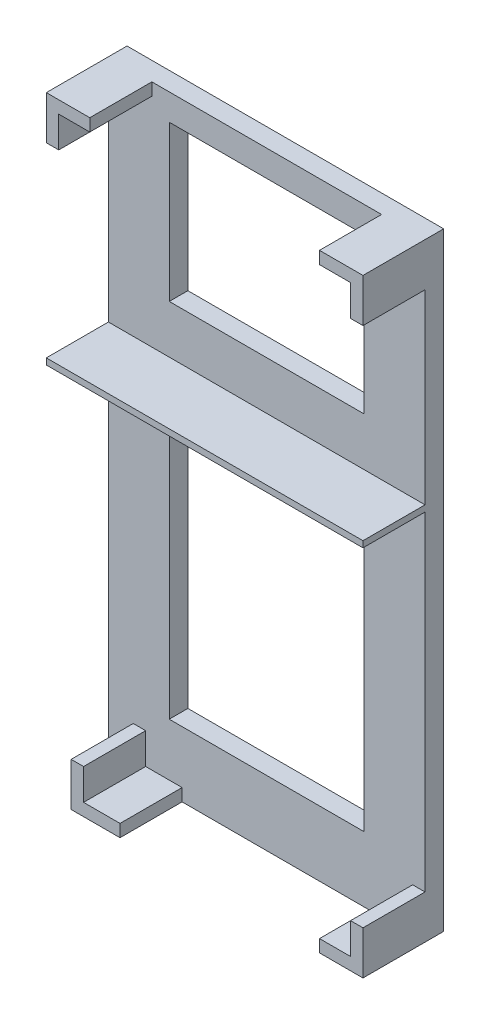
ISO-10303-21;
HEADER;
FILE_DESCRIPTION(('STEP AP214'),'2;1');
FILE_NAME('part.step','',(''),(''),'','','');
FILE_SCHEMA(('AUTOMOTIVE_DESIGN { 1 0 10303 214 1 1 1 1 }'));
ENDSEC;
DATA;
#1=APPLICATION_CONTEXT('core data for automotive mechanical design processes');
#2=APPLICATION_PROTOCOL_DEFINITION('international standard','automotive_design',2000,#1);
#3=PRODUCT_CONTEXT('',#1,'mechanical');
#4=PRODUCT('Part','Part','',(#3));
#5=PRODUCT_RELATED_PRODUCT_CATEGORY('part','',(#4));
#6=PRODUCT_DEFINITION_FORMATION('','',#4);
#7=PRODUCT_DEFINITION_CONTEXT('part definition',#1,'design');
#8=PRODUCT_DEFINITION('design','',#6,#7);
#9=PRODUCT_DEFINITION_SHAPE('','',#8);
#10=(LENGTH_UNIT() NAMED_UNIT(*) SI_UNIT(.MILLI.,.METRE.));
#11=(NAMED_UNIT(*) PLANE_ANGLE_UNIT() SI_UNIT($,.RADIAN.));
#12=(NAMED_UNIT(*) SI_UNIT($,.STERADIAN.) SOLID_ANGLE_UNIT());
#13=UNCERTAINTY_MEASURE_WITH_UNIT(LENGTH_MEASURE(1.E-05),#10,'distance_accuracy_value','');
#14=(GEOMETRIC_REPRESENTATION_CONTEXT(3) GLOBAL_UNCERTAINTY_ASSIGNED_CONTEXT((#13)) GLOBAL_UNIT_ASSIGNED_CONTEXT((#10,
#11,#12)) REPRESENTATION_CONTEXT('',''));
#15=CARTESIAN_POINT('',(0.,0.,0.));
#16=DIRECTION('',(0.,0.,1.));
#17=DIRECTION('',(1.,0.,0.));
#18=AXIS2_PLACEMENT_3D('',#15,#16,#17);
#19=CARTESIAN_POINT('',(0.,0.,3.));
#20=DIRECTION('',(0.,0.,1.));
#21=DIRECTION('',(1.,0.,0.));
#22=AXIS2_PLACEMENT_3D('',#19,#20,#21);
#23=PLANE('',#22);
#24=DIRECTION('',(0.,1.,0.));
#25=VECTOR('',#24,1.);
#26=CARTESIAN_POINT('',(41.2,10.5,3.));
#27=LINE('',#26,#25);
#28=CARTESIAN_POINT('',(41.2,10.5,3.));
#29=VERTEX_POINT('',#28);
#30=CARTESIAN_POINT('',(41.2,50.5,3.));
#31=VERTEX_POINT('',#30);
#32=EDGE_CURVE('E52',#29,#31,#27,.T.);
#33=ORIENTED_EDGE('',*,*,#32,.F.);
#34=DIRECTION('',(1.,0.,0.));
#35=VECTOR('',#34,1.);
#36=CARTESIAN_POINT('',(9.8,10.5,3.));
#37=LINE('',#36,#35);
#38=CARTESIAN_POINT('',(9.8,10.5,3.));
#39=VERTEX_POINT('',#38);
#40=EDGE_CURVE('E319',#39,#29,#37,.T.);
#41=ORIENTED_EDGE('',*,*,#40,.F.);
#42=DIRECTION('',(0.,-1.,0.));
#43=VECTOR('',#42,1.);
#44=CARTESIAN_POINT('',(9.8,50.5,3.));
#45=LINE('',#44,#43);
#46=CARTESIAN_POINT('',(9.8,50.5,3.));
#47=VERTEX_POINT('',#46);
#48=EDGE_CURVE('E322',#47,#39,#45,.T.);
#49=ORIENTED_EDGE('',*,*,#48,.F.);
#50=DIRECTION('',(-1.,0.,0.));
#51=VECTOR('',#50,1.);
#52=CARTESIAN_POINT('',(39.8,50.5,3.));
#53=LINE('',#52,#51);
#54=EDGE_CURVE('E325',#31,#47,#53,.T.);
#55=ORIENTED_EDGE('',*,*,#54,.F.);
#56=EDGE_LOOP('',(#33,#41,#49,#55));
#57=FACE_BOUND('',#56,.T.);
#58=DIRECTION('',(-1.,0.,0.));
#59=VECTOR('',#58,1.);
#60=CARTESIAN_POINT('',(51.,60.,3.));
#61=LINE('',#60,#59);
#62=CARTESIAN_POINT('',(51.,60.,3.));
#63=VERTEX_POINT('',#62);
#64=CARTESIAN_POINT('',(0.,60.,3.));
#65=VERTEX_POINT('',#64);
#66=EDGE_CURVE('E307',#63,#65,#61,.T.);
#67=ORIENTED_EDGE('',*,*,#66,.T.);
#68=DIRECTION('',(0.,1.,0.));
#69=VECTOR('',#68,1.);
#70=CARTESIAN_POINT('',(0.,0.,3.));
#71=LINE('',#70,#69);
#72=CARTESIAN_POINT('',(0.,0.,3.));
#73=VERTEX_POINT('',#72);
#74=EDGE_CURVE('E533',#73,#65,#71,.T.);
#75=ORIENTED_EDGE('',*,*,#74,.F.);
#76=DIRECTION('',(1.,0.,0.));
#77=VECTOR('',#76,1.);
#78=CARTESIAN_POINT('',(0.,0.,3.));
#79=LINE('',#78,#77);
#80=CARTESIAN_POINT('',(4.,0.,3.));
#81=VERTEX_POINT('',#80);
#82=EDGE_CURVE('E530',#73,#81,#79,.T.);
#83=ORIENTED_EDGE('',*,*,#82,.T.);
#84=DIRECTION('',(0.,1.,0.));
#85=VECTOR('',#84,1.);
#86=CARTESIAN_POINT('',(4.,0.,3.));
#87=LINE('',#86,#85);
#88=CARTESIAN_POINT('',(4.,7.,3.));
#89=VERTEX_POINT('',#88);
#90=EDGE_CURVE('E379',#81,#89,#87,.T.);
#91=ORIENTED_EDGE('',*,*,#90,.T.);
#92=DIRECTION('',(1.,0.,0.));
#93=VECTOR('',#92,1.);
#94=CARTESIAN_POINT('',(4.,7.,3.));
#95=LINE('',#94,#93);
#96=CARTESIAN_POINT('',(6.,7.,3.));
#97=VERTEX_POINT('',#96);
#98=EDGE_CURVE('E381',#89,#97,#95,.T.);
#99=ORIENTED_EDGE('',*,*,#98,.T.);
#100=DIRECTION('',(0.,-1.,0.));
#101=VECTOR('',#100,1.);
#102=CARTESIAN_POINT('',(6.,7.,3.));
#103=LINE('',#102,#101);
#104=CARTESIAN_POINT('',(6.,2.,3.));
#105=VERTEX_POINT('',#104);
#106=EDGE_CURVE('E383',#97,#105,#103,.T.);
#107=ORIENTED_EDGE('',*,*,#106,.T.);
#108=DIRECTION('',(1.,0.,0.));
#109=VECTOR('',#108,1.);
#110=CARTESIAN_POINT('',(6.,2.,3.));
#111=LINE('',#110,#109);
#112=CARTESIAN_POINT('',(11.8694826208288,2.,3.));
#113=VERTEX_POINT('',#112);
#114=EDGE_CURVE('E361',#105,#113,#111,.T.);
#115=ORIENTED_EDGE('',*,*,#114,.T.);
#116=DIRECTION('',(0.,-1.,0.));
#117=VECTOR('',#116,1.);
#118=CARTESIAN_POINT('',(11.8694826208288,2.,3.));
#119=LINE('',#118,#117);
#120=CARTESIAN_POINT('',(11.8694826208288,0.,3.));
#121=VERTEX_POINT('',#120);
#122=EDGE_CURVE('E348',#113,#121,#119,.T.);
#123=ORIENTED_EDGE('',*,*,#122,.T.);
#124=CARTESIAN_POINT('',(44.,0.,3.));
#125=VERTEX_POINT('',#124);
#126=EDGE_CURVE('E529',#121,#125,#79,.T.);
#127=ORIENTED_EDGE('',*,*,#126,.T.);
#128=DIRECTION('',(0.,-1.,0.));
#129=VECTOR('',#128,1.);
#130=CARTESIAN_POINT('',(44.,0.,3.));
#131=LINE('',#130,#129);
#132=CARTESIAN_POINT('',(44.,2.,3.));
#133=VERTEX_POINT('',#132);
#134=EDGE_CURVE('E408',#133,#125,#131,.T.);
#135=ORIENTED_EDGE('',*,*,#134,.F.);
#136=DIRECTION('',(-1.,0.,0.));
#137=VECTOR('',#136,1.);
#138=CARTESIAN_POINT('',(44.,2.,3.));
#139=LINE('',#138,#137);
#140=CARTESIAN_POINT('',(49.,2.,3.));
#141=VERTEX_POINT('',#140);
#142=EDGE_CURVE('E425',#141,#133,#139,.T.);
#143=ORIENTED_EDGE('',*,*,#142,.F.);
#144=DIRECTION('',(0.,-1.,0.));
#145=VECTOR('',#144,1.);
#146=CARTESIAN_POINT('',(49.,2.,3.));
#147=LINE('',#146,#145);
#148=CARTESIAN_POINT('',(49.,7.,3.));
#149=VERTEX_POINT('',#148);
#150=EDGE_CURVE('E422',#149,#141,#147,.T.);
#151=ORIENTED_EDGE('',*,*,#150,.F.);
#152=DIRECTION('',(-1.,0.,0.));
#153=VECTOR('',#152,1.);
#154=CARTESIAN_POINT('',(49.,7.,3.));
#155=LINE('',#154,#153);
#156=CARTESIAN_POINT('',(51.,7.,3.));
#157=VERTEX_POINT('',#156);
#158=EDGE_CURVE('E389',#157,#149,#155,.T.);
#159=ORIENTED_EDGE('',*,*,#158,.F.);
#160=DIRECTION('',(0.,1.,0.));
#161=VECTOR('',#160,1.);
#162=CARTESIAN_POINT('',(51.,0.,3.));
#163=LINE('',#162,#161);
#164=EDGE_CURVE('E527',#157,#63,#163,.T.);
#165=ORIENTED_EDGE('',*,*,#164,.T.);
#166=EDGE_LOOP('',(#67,#75,#83,#91,#99,#107,#115,#123,#127,#135,#143,#151,#159,#165));
#167=FACE_BOUND('',#166,.T.);
#168=ADVANCED_FACE('F37',(#57,#167),#23,.T.);
#169=DIRECTION('',(0.,1.,0.));
#170=VECTOR('',#169,1.);
#171=CARTESIAN_POINT('',(41.2,68.7705321312806,3.));
#172=LINE('',#171,#170);
#173=CARTESIAN_POINT('',(41.2,68.7705321312806,3.));
#174=VERTEX_POINT('',#173);
#175=CARTESIAN_POINT('',(41.2,93.7705321312806,3.));
#176=VERTEX_POINT('',#175);
#177=EDGE_CURVE('E60',#174,#176,#172,.T.);
#178=ORIENTED_EDGE('',*,*,#177,.F.);
#179=DIRECTION('',(1.,0.,0.));
#180=VECTOR('',#179,1.);
#181=CARTESIAN_POINT('',(9.8,68.7705321312806,3.));
#182=LINE('',#181,#180);
#183=CARTESIAN_POINT('',(9.8,68.7705321312806,3.));
#184=VERTEX_POINT('',#183);
#185=EDGE_CURVE('E300',#184,#174,#182,.T.);
#186=ORIENTED_EDGE('',*,*,#185,.F.);
#187=DIRECTION('',(0.,-1.,0.));
#188=VECTOR('',#187,1.);
#189=CARTESIAN_POINT('',(9.8,93.7705321312806,3.));
#190=LINE('',#189,#188);
#191=CARTESIAN_POINT('',(9.8,93.7705321312806,3.));
#192=VERTEX_POINT('',#191);
#193=EDGE_CURVE('E283',#192,#184,#190,.T.);
#194=ORIENTED_EDGE('',*,*,#193,.F.);
#195=DIRECTION('',(-1.,0.,0.));
#196=VECTOR('',#195,1.);
#197=CARTESIAN_POINT('',(39.8,93.7705321312806,3.));
#198=LINE('',#197,#196);
#199=EDGE_CURVE('E293',#176,#192,#198,.T.);
#200=ORIENTED_EDGE('',*,*,#199,.F.);
#201=EDGE_LOOP('',(#178,#186,#194,#200));
#202=FACE_BOUND('',#201,.T.);
#203=DIRECTION('',(1.,0.,0.));
#204=VECTOR('',#203,1.);
#205=CARTESIAN_POINT('',(0.,61.,3.));
#206=LINE('',#205,#204);
#207=CARTESIAN_POINT('',(0.,61.,3.));
#208=VERTEX_POINT('',#207);
#209=CARTESIAN_POINT('',(51.,61.,3.));
#210=VERTEX_POINT('',#209);
#211=EDGE_CURVE('E332',#208,#210,#206,.T.);
#212=ORIENTED_EDGE('',*,*,#211,.T.);
#213=CARTESIAN_POINT('',(51.,91.,3.));
#214=VERTEX_POINT('',#213);
#215=EDGE_CURVE('E525',#210,#214,#163,.T.);
#216=ORIENTED_EDGE('',*,*,#215,.T.);
#217=DIRECTION('',(1.,0.,0.));
#218=VECTOR('',#217,1.);
#219=CARTESIAN_POINT('',(49.,91.,3.));
#220=LINE('',#219,#218);
#221=CARTESIAN_POINT('',(49.,91.,3.));
#222=VERTEX_POINT('',#221);
#223=EDGE_CURVE('E449',#222,#214,#220,.T.);
#224=ORIENTED_EDGE('',*,*,#223,.F.);
#225=DIRECTION('',(0.,-1.,0.));
#226=VECTOR('',#225,1.);
#227=CARTESIAN_POINT('',(49.,96.,3.));
#228=LINE('',#227,#226);
#229=CARTESIAN_POINT('',(49.,96.,3.));
#230=VERTEX_POINT('',#229);
#231=EDGE_CURVE('E463',#230,#222,#228,.T.);
#232=ORIENTED_EDGE('',*,*,#231,.F.);
#233=DIRECTION('',(1.,0.,0.));
#234=VECTOR('',#233,1.);
#235=CARTESIAN_POINT('',(44.,96.,3.));
#236=LINE('',#235,#234);
#237=CARTESIAN_POINT('',(44.,96.,3.));
#238=VERTEX_POINT('',#237);
#239=EDGE_CURVE('E461',#238,#230,#236,.T.);
#240=ORIENTED_EDGE('',*,*,#239,.F.);
#241=DIRECTION('',(0.,-1.,0.));
#242=VECTOR('',#241,1.);
#243=CARTESIAN_POINT('',(44.,98.,3.));
#244=LINE('',#243,#242);
#245=CARTESIAN_POINT('',(44.,98.,3.));
#246=VERTEX_POINT('',#245);
#247=EDGE_CURVE('E444',#246,#238,#244,.T.);
#248=ORIENTED_EDGE('',*,*,#247,.F.);
#249=DIRECTION('',(1.,0.,0.));
#250=VECTOR('',#249,1.);
#251=CARTESIAN_POINT('',(0.,98.,3.));
#252=LINE('',#251,#250);
#253=CARTESIAN_POINT('',(7.,98.,3.));
#254=VERTEX_POINT('',#253);
#255=EDGE_CURVE('E522',#254,#246,#252,.T.);
#256=ORIENTED_EDGE('',*,*,#255,.F.);
#257=DIRECTION('',(0.,1.,0.));
#258=VECTOR('',#257,1.);
#259=CARTESIAN_POINT('',(7.,98.,3.));
#260=LINE('',#259,#258);
#261=CARTESIAN_POINT('',(7.,96.,3.));
#262=VERTEX_POINT('',#261);
#263=EDGE_CURVE('E485',#262,#254,#260,.T.);
#264=ORIENTED_EDGE('',*,*,#263,.F.);
#265=DIRECTION('',(1.,0.,0.));
#266=VECTOR('',#265,1.);
#267=CARTESIAN_POINT('',(7.,96.,3.));
#268=LINE('',#267,#266);
#269=CARTESIAN_POINT('',(2.,96.,3.));
#270=VERTEX_POINT('',#269);
#271=EDGE_CURVE('E502',#270,#262,#268,.T.);
#272=ORIENTED_EDGE('',*,*,#271,.F.);
#273=DIRECTION('',(0.,1.,0.));
#274=VECTOR('',#273,1.);
#275=CARTESIAN_POINT('',(2.,96.,3.));
#276=LINE('',#275,#274);
#277=CARTESIAN_POINT('',(2.,91.,3.));
#278=VERTEX_POINT('',#277);
#279=EDGE_CURVE('E499',#278,#270,#276,.T.);
#280=ORIENTED_EDGE('',*,*,#279,.F.);
#281=DIRECTION('',(1.,0.,0.));
#282=VECTOR('',#281,1.);
#283=CARTESIAN_POINT('',(2.,91.,3.));
#284=LINE('',#283,#282);
#285=CARTESIAN_POINT('',(0.,91.,3.));
#286=VERTEX_POINT('',#285);
#287=EDGE_CURVE('E480',#286,#278,#284,.T.);
#288=ORIENTED_EDGE('',*,*,#287,.F.);
#289=EDGE_CURVE('E532',#208,#286,#71,.T.);
#290=ORIENTED_EDGE('',*,*,#289,.F.);
#291=EDGE_LOOP('',(#212,#216,#224,#232,#240,#248,#256,#264,#272,#280,#288,#290));
#292=FACE_BOUND('',#291,.T.);
#293=ADVANCED_FACE('F297',(#202,#292),#23,.T.);
#294=CARTESIAN_POINT('',(0.,98.,3.));
#295=DIRECTION('',(0.,1.,0.));
#296=DIRECTION('',(0.,0.,1.));
#297=AXIS2_PLACEMENT_3D('',#294,#295,#296);
#298=PLANE('',#297);
#299=DIRECTION('',(1.,0.,0.));
#300=VECTOR('',#299,1.);
#301=CARTESIAN_POINT('',(0.,98.,0.));
#302=LINE('',#301,#300);
#303=CARTESIAN_POINT('',(0.,98.,0.));
#304=VERTEX_POINT('',#303);
#305=CARTESIAN_POINT('',(51.,98.,0.));
#306=VERTEX_POINT('',#305);
#307=EDGE_CURVE('E521',#304,#306,#302,.T.);
#308=ORIENTED_EDGE('',*,*,#307,.F.);
#309=DIRECTION('',(0.,0.,-1.));
#310=VECTOR('',#309,1.);
#311=CARTESIAN_POINT('',(0.,98.,3.));
#312=LINE('',#311,#310);
#313=CARTESIAN_POINT('',(0.,98.,13.));
#314=VERTEX_POINT('',#313);
#315=EDGE_CURVE('E546',#314,#304,#312,.T.);
#316=ORIENTED_EDGE('',*,*,#315,.F.);
#317=DIRECTION('',(-1.,0.,0.));
#318=VECTOR('',#317,1.);
#319=CARTESIAN_POINT('',(0.,98.,13.));
#320=LINE('',#319,#318);
#321=CARTESIAN_POINT('',(7.,98.,13.));
#322=VERTEX_POINT('',#321);
#323=EDGE_CURVE('E493',#322,#314,#320,.T.);
#324=ORIENTED_EDGE('',*,*,#323,.F.);
#325=DIRECTION('',(0.,0.,-1.));
#326=VECTOR('',#325,1.);
#327=CARTESIAN_POINT('',(7.,98.,13.));
#328=LINE('',#327,#326);
#329=EDGE_CURVE('E496',#322,#254,#328,.T.);
#330=ORIENTED_EDGE('',*,*,#329,.T.);
#331=ORIENTED_EDGE('',*,*,#255,.T.);
#332=DIRECTION('',(0.,0.,-1.));
#333=VECTOR('',#332,1.);
#334=CARTESIAN_POINT('',(44.,98.,13.));
#335=LINE('',#334,#333);
#336=CARTESIAN_POINT('',(44.,98.,13.));
#337=VERTEX_POINT('',#336);
#338=EDGE_CURVE('E478',#337,#246,#335,.T.);
#339=ORIENTED_EDGE('',*,*,#338,.F.);
#340=DIRECTION('',(-1.,0.,0.));
#341=VECTOR('',#340,1.);
#342=CARTESIAN_POINT('',(51.,98.,13.));
#343=LINE('',#342,#341);
#344=CARTESIAN_POINT('',(51.,98.,13.));
#345=VERTEX_POINT('',#344);
#346=EDGE_CURVE('E448',#345,#337,#343,.T.);
#347=ORIENTED_EDGE('',*,*,#346,.F.);
#348=DIRECTION('',(0.,0.,-1.));
#349=VECTOR('',#348,1.);
#350=CARTESIAN_POINT('',(51.,98.,3.));
#351=LINE('',#350,#349);
#352=EDGE_CURVE('E536',#345,#306,#351,.T.);
#353=ORIENTED_EDGE('',*,*,#352,.T.);
#354=EDGE_LOOP('',(#308,#316,#324,#330,#331,#339,#347,#353));
#355=FACE_BOUND('',#354,.T.);
#356=ADVANCED_FACE('F39',(#355),#298,.T.);
#357=CARTESIAN_POINT('',(0.,0.,3.));
#358=DIRECTION('',(-1.,0.,0.));
#359=DIRECTION('',(0.,0.,1.));
#360=AXIS2_PLACEMENT_3D('',#357,#358,#359);
#361=PLANE('',#360);
#362=DIRECTION('',(0.,1.,0.));
#363=VECTOR('',#362,1.);
#364=CARTESIAN_POINT('',(0.,0.,0.));
#365=LINE('',#364,#363);
#366=CARTESIAN_POINT('',(0.,0.,0.));
#367=VERTEX_POINT('',#366);
#368=EDGE_CURVE('E526',#367,#304,#365,.T.);
#369=ORIENTED_EDGE('',*,*,#368,.F.);
#370=DIRECTION('',(0.,0.,-1.));
#371=VECTOR('',#370,1.);
#372=CARTESIAN_POINT('',(0.,0.,3.));
#373=LINE('',#372,#371);
#374=EDGE_CURVE('E549',#73,#367,#373,.T.);
#375=ORIENTED_EDGE('',*,*,#374,.F.);
#376=ORIENTED_EDGE('',*,*,#74,.T.);
#377=DIRECTION('',(0.,0.,-1.));
#378=VECTOR('',#377,1.);
#379=CARTESIAN_POINT('',(0.,60.,13.));
#380=LINE('',#379,#378);
#381=CARTESIAN_POINT('',(0.,60.,13.));
#382=VERTEX_POINT('',#381);
#383=EDGE_CURVE('E341',#382,#65,#380,.T.);
#384=ORIENTED_EDGE('',*,*,#383,.F.);
#385=DIRECTION('',(0.,1.,0.));
#386=VECTOR('',#385,1.);
#387=CARTESIAN_POINT('',(0.,60.,13.));
#388=LINE('',#387,#386);
#389=CARTESIAN_POINT('',(0.,61.,13.));
#390=VERTEX_POINT('',#389);
#391=EDGE_CURVE('E331',#382,#390,#388,.T.);
#392=ORIENTED_EDGE('',*,*,#391,.T.);
#393=DIRECTION('',(0.,0.,-1.));
#394=VECTOR('',#393,1.);
#395=CARTESIAN_POINT('',(0.,61.,13.));
#396=LINE('',#395,#394);
#397=EDGE_CURVE('E352',#390,#208,#396,.T.);
#398=ORIENTED_EDGE('',*,*,#397,.T.);
#399=ORIENTED_EDGE('',*,*,#289,.T.);
#400=DIRECTION('',(0.,0.,-1.));
#401=VECTOR('',#400,1.);
#402=CARTESIAN_POINT('',(0.,91.,13.));
#403=LINE('',#402,#401);
#404=CARTESIAN_POINT('',(0.,91.,13.));
#405=VERTEX_POINT('',#404);
#406=EDGE_CURVE('E518',#405,#286,#403,.T.);
#407=ORIENTED_EDGE('',*,*,#406,.F.);
#408=DIRECTION('',(0.,-1.,0.));
#409=VECTOR('',#408,1.);
#410=CARTESIAN_POINT('',(0.,91.,13.));
#411=LINE('',#410,#409);
#412=EDGE_CURVE('E481',#314,#405,#411,.T.);
#413=ORIENTED_EDGE('',*,*,#412,.F.);
#414=ORIENTED_EDGE('',*,*,#315,.T.);
#415=EDGE_LOOP('',(#369,#375,#376,#384,#392,#398,#399,#407,#413,#414));
#416=FACE_BOUND('',#415,.T.);
#417=ADVANCED_FACE('F602',(#416),#361,.T.);
#418=CARTESIAN_POINT('',(0.,0.,3.));
#419=DIRECTION('',(0.,1.,0.));
#420=DIRECTION('',(-1.,0.,0.));
#421=AXIS2_PLACEMENT_3D('',#418,#419,#420);
#422=PLANE('',#421);
#423=DIRECTION('',(1.,0.,0.));
#424=VECTOR('',#423,1.);
#425=CARTESIAN_POINT('',(0.,0.,0.));
#426=LINE('',#425,#424);
#427=CARTESIAN_POINT('',(51.,0.,0.));
#428=VERTEX_POINT('',#427);
#429=EDGE_CURVE('E542',#367,#428,#426,.T.);
#430=ORIENTED_EDGE('',*,*,#429,.T.);
#431=DIRECTION('',(0.,0.,-1.));
#432=VECTOR('',#431,1.);
#433=CARTESIAN_POINT('',(51.,0.,3.));
#434=LINE('',#433,#432);
#435=CARTESIAN_POINT('',(51.,0.,13.));
#436=VERTEX_POINT('',#435);
#437=EDGE_CURVE('E551',#436,#428,#434,.T.);
#438=ORIENTED_EDGE('',*,*,#437,.F.);
#439=DIRECTION('',(1.,0.,0.));
#440=VECTOR('',#439,1.);
#441=CARTESIAN_POINT('',(51.,0.,13.));
#442=LINE('',#441,#440);
#443=CARTESIAN_POINT('',(44.,0.,13.));
#444=VERTEX_POINT('',#443);
#445=EDGE_CURVE('E416',#444,#436,#442,.T.);
#446=ORIENTED_EDGE('',*,*,#445,.F.);
#447=DIRECTION('',(0.,0.,-1.));
#448=VECTOR('',#447,1.);
#449=CARTESIAN_POINT('',(44.,0.,13.));
#450=LINE('',#449,#448);
#451=EDGE_CURVE('E419',#444,#125,#450,.T.);
#452=ORIENTED_EDGE('',*,*,#451,.T.);
#453=ORIENTED_EDGE('',*,*,#126,.F.);
#454=DIRECTION('',(0.,0.,-1.));
#455=VECTOR('',#454,1.);
#456=CARTESIAN_POINT('',(11.8694826208288,0.,13.));
#457=LINE('',#456,#455);
#458=CARTESIAN_POINT('',(11.8694826208288,0.,13.));
#459=VERTEX_POINT('',#458);
#460=EDGE_CURVE('E376',#459,#121,#457,.T.);
#461=ORIENTED_EDGE('',*,*,#460,.F.);
#462=DIRECTION('',(-1.,0.,0.));
#463=VECTOR('',#462,1.);
#464=CARTESIAN_POINT('',(11.8694826208288,0.,13.));
#465=LINE('',#464,#463);
#466=CARTESIAN_POINT('',(4.,0.,13.));
#467=VERTEX_POINT('',#466);
#468=EDGE_CURVE('E360',#459,#467,#465,.T.);
#469=ORIENTED_EDGE('',*,*,#468,.T.);
#470=DIRECTION('',(0.,0.,-1.));
#471=VECTOR('',#470,1.);
#472=CARTESIAN_POINT('',(4.,0.,13.));
#473=LINE('',#472,#471);
#474=EDGE_CURVE('E399',#467,#81,#473,.T.);
#475=ORIENTED_EDGE('',*,*,#474,.T.);
#476=ORIENTED_EDGE('',*,*,#82,.F.);
#477=ORIENTED_EDGE('',*,*,#374,.T.);
#478=EDGE_LOOP('',(#430,#438,#446,#452,#453,#461,#469,#475,#476,#477));
#479=FACE_BOUND('',#478,.T.);
#480=ADVANCED_FACE('F605',(#479),#422,.F.);
#481=CARTESIAN_POINT('',(51.,0.,3.));
#482=DIRECTION('',(-1.,0.,0.));
#483=DIRECTION('',(0.,-1.,0.));
#484=AXIS2_PLACEMENT_3D('',#481,#482,#483);
#485=PLANE('',#484);
#486=DIRECTION('',(0.,1.,0.));
#487=VECTOR('',#486,1.);
#488=CARTESIAN_POINT('',(51.,0.,0.));
#489=LINE('',#488,#487);
#490=EDGE_CURVE('E539',#428,#306,#489,.T.);
#491=ORIENTED_EDGE('',*,*,#490,.T.);
#492=ORIENTED_EDGE('',*,*,#352,.F.);
#493=DIRECTION('',(0.,1.,0.));
#494=VECTOR('',#493,1.);
#495=CARTESIAN_POINT('',(51.,91.,13.));
#496=LINE('',#495,#494);
#497=CARTESIAN_POINT('',(51.,91.,13.));
#498=VERTEX_POINT('',#497);
#499=EDGE_CURVE('E445',#498,#345,#496,.T.);
#500=ORIENTED_EDGE('',*,*,#499,.F.);
#501=DIRECTION('',(0.,0.,-1.));
#502=VECTOR('',#501,1.);
#503=CARTESIAN_POINT('',(51.,91.,13.));
#504=LINE('',#503,#502);
#505=EDGE_CURVE('E459',#498,#214,#504,.T.);
#506=ORIENTED_EDGE('',*,*,#505,.T.);
#507=ORIENTED_EDGE('',*,*,#215,.F.);
#508=DIRECTION('',(0.,0.,-1.));
#509=VECTOR('',#508,1.);
#510=CARTESIAN_POINT('',(51.,61.,13.));
#511=LINE('',#510,#509);
#512=CARTESIAN_POINT('',(51.,61.,13.));
#513=VERTEX_POINT('',#512);
#514=EDGE_CURVE('E349',#513,#210,#511,.T.);
#515=ORIENTED_EDGE('',*,*,#514,.F.);
#516=DIRECTION('',(0.,-1.,0.));
#517=VECTOR('',#516,1.);
#518=CARTESIAN_POINT('',(51.,61.,13.));
#519=LINE('',#518,#517);
#520=CARTESIAN_POINT('',(51.,60.,13.));
#521=VERTEX_POINT('',#520);
#522=EDGE_CURVE('E338',#513,#521,#519,.T.);
#523=ORIENTED_EDGE('',*,*,#522,.T.);
#524=DIRECTION('',(0.,0.,-1.));
#525=VECTOR('',#524,1.);
#526=CARTESIAN_POINT('',(51.,60.,13.));
#527=LINE('',#526,#525);
#528=EDGE_CURVE('E345',#521,#63,#527,.T.);
#529=ORIENTED_EDGE('',*,*,#528,.T.);
#530=ORIENTED_EDGE('',*,*,#164,.F.);
#531=DIRECTION('',(0.,0.,-1.));
#532=VECTOR('',#531,1.);
#533=CARTESIAN_POINT('',(51.,7.,13.));
#534=LINE('',#533,#532);
#535=CARTESIAN_POINT('',(51.,7.,13.));
#536=VERTEX_POINT('',#535);
#537=EDGE_CURVE('E441',#536,#157,#534,.T.);
#538=ORIENTED_EDGE('',*,*,#537,.F.);
#539=DIRECTION('',(0.,1.,0.));
#540=VECTOR('',#539,1.);
#541=CARTESIAN_POINT('',(51.,7.,13.));
#542=LINE('',#541,#540);
#543=EDGE_CURVE('E404',#436,#536,#542,.T.);
#544=ORIENTED_EDGE('',*,*,#543,.F.);
#545=ORIENTED_EDGE('',*,*,#437,.T.);
#546=EDGE_LOOP('',(#491,#492,#500,#506,#507,#515,#523,#529,#530,#538,#544,#545));
#547=FACE_BOUND('',#546,.T.);
#548=ADVANCED_FACE('F601',(#547),#485,.F.);
#549=CARTESIAN_POINT('',(0.,0.,0.));
#550=DIRECTION('',(0.,0.,1.));
#551=DIRECTION('',(1.,0.,0.));
#552=AXIS2_PLACEMENT_3D('',#549,#550,#551);
#553=PLANE('',#552);
#554=DIRECTION('',(1.,0.,0.));
#555=VECTOR('',#554,1.);
#556=CARTESIAN_POINT('',(0.,68.7705321312806,0.));
#557=LINE('',#556,#555);
#558=CARTESIAN_POINT('',(9.8,68.7705321312806,0.));
#559=VERTEX_POINT('',#558);
#560=CARTESIAN_POINT('',(41.2,68.7705321312806,0.));
#561=VERTEX_POINT('',#560);
#562=EDGE_CURVE('E45',#559,#561,#557,.T.);
#563=ORIENTED_EDGE('',*,*,#562,.T.);
#564=DIRECTION('',(0.,1.,0.));
#565=VECTOR('',#564,1.);
#566=CARTESIAN_POINT('',(41.2,0.,0.));
#567=LINE('',#566,#565);
#568=CARTESIAN_POINT('',(41.2,93.7705321312806,0.));
#569=VERTEX_POINT('',#568);
#570=EDGE_CURVE('E11',#561,#569,#567,.T.);
#571=ORIENTED_EDGE('',*,*,#570,.T.);
#572=DIRECTION('',(-1.,0.,0.));
#573=VECTOR('',#572,1.);
#574=CARTESIAN_POINT('',(0.,93.7705321312806,0.));
#575=LINE('',#574,#573);
#576=CARTESIAN_POINT('',(9.8,93.7705321312806,0.));
#577=VERTEX_POINT('',#576);
#578=EDGE_CURVE('E566',#569,#577,#575,.T.);
#579=ORIENTED_EDGE('',*,*,#578,.T.);
#580=DIRECTION('',(0.,-1.,0.));
#581=VECTOR('',#580,1.);
#582=CARTESIAN_POINT('',(9.8,0.,0.));
#583=LINE('',#582,#581);
#584=EDGE_CURVE('E286',#577,#559,#583,.T.);
#585=ORIENTED_EDGE('',*,*,#584,.T.);
#586=EDGE_LOOP('',(#563,#571,#579,#585));
#587=FACE_BOUND('',#586,.T.);
#588=DIRECTION('',(1.,0.,0.));
#589=VECTOR('',#588,1.);
#590=CARTESIAN_POINT('',(0.,10.5,0.));
#591=LINE('',#590,#589);
#592=CARTESIAN_POINT('',(9.8,10.5,0.));
#593=VERTEX_POINT('',#592);
#594=CARTESIAN_POINT('',(41.2,10.5,0.));
#595=VERTEX_POINT('',#594);
#596=EDGE_CURVE('E560',#593,#595,#591,.T.);
#597=ORIENTED_EDGE('',*,*,#596,.T.);
#598=DIRECTION('',(0.,1.,0.));
#599=VECTOR('',#598,1.);
#600=CARTESIAN_POINT('',(41.2,0.,0.));
#601=LINE('',#600,#599);
#602=CARTESIAN_POINT('',(41.2,50.5,0.));
#603=VERTEX_POINT('',#602);
#604=EDGE_CURVE('E563',#595,#603,#601,.T.);
#605=ORIENTED_EDGE('',*,*,#604,.T.);
#606=DIRECTION('',(-1.,0.,0.));
#607=VECTOR('',#606,1.);
#608=CARTESIAN_POINT('',(0.,50.5,0.));
#609=LINE('',#608,#607);
#610=CARTESIAN_POINT('',(9.8,50.5,0.));
#611=VERTEX_POINT('',#610);
#612=EDGE_CURVE('E548',#603,#611,#609,.T.);
#613=ORIENTED_EDGE('',*,*,#612,.T.);
#614=DIRECTION('',(0.,-1.,0.));
#615=VECTOR('',#614,1.);
#616=CARTESIAN_POINT('',(9.8,0.,0.));
#617=LINE('',#616,#615);
#618=EDGE_CURVE('E557',#611,#593,#617,.T.);
#619=ORIENTED_EDGE('',*,*,#618,.T.);
#620=EDGE_LOOP('',(#597,#605,#613,#619));
#621=FACE_BOUND('',#620,.T.);
#622=ORIENTED_EDGE('',*,*,#307,.T.);
#623=ORIENTED_EDGE('',*,*,#490,.F.);
#624=ORIENTED_EDGE('',*,*,#429,.F.);
#625=ORIENTED_EDGE('',*,*,#368,.T.);
#626=EDGE_LOOP('',(#622,#623,#624,#625));
#627=FACE_BOUND('',#626,.T.);
#628=ADVANCED_FACE('F570',(#587,#621,#627),#553,.F.);
#629=CARTESIAN_POINT('',(2.,91.,13.));
#630=DIRECTION('',(0.,1.,0.));
#631=DIRECTION('',(0.,0.,1.));
#632=AXIS2_PLACEMENT_3D('',#629,#630,#631);
#633=PLANE('',#632);
#634=ORIENTED_EDGE('',*,*,#287,.T.);
#635=DIRECTION('',(0.,0.,-1.));
#636=VECTOR('',#635,1.);
#637=CARTESIAN_POINT('',(2.,91.,13.));
#638=LINE('',#637,#636);
#639=CARTESIAN_POINT('',(2.,91.,13.));
#640=VERTEX_POINT('',#639);
#641=EDGE_CURVE('E515',#640,#278,#638,.T.);
#642=ORIENTED_EDGE('',*,*,#641,.F.);
#643=DIRECTION('',(1.,0.,0.));
#644=VECTOR('',#643,1.);
#645=CARTESIAN_POINT('',(2.,91.,13.));
#646=LINE('',#645,#644);
#647=EDGE_CURVE('E484',#405,#640,#646,.T.);
#648=ORIENTED_EDGE('',*,*,#647,.F.);
#649=ORIENTED_EDGE('',*,*,#406,.T.);
#650=EDGE_LOOP('',(#634,#642,#648,#649));
#651=FACE_BOUND('',#650,.T.);
#652=ADVANCED_FACE('F597',(#651),#633,.F.);
#653=CARTESIAN_POINT('',(2.,96.,13.));
#654=DIRECTION('',(-1.,0.,0.));
#655=DIRECTION('',(0.,-1.,0.));
#656=AXIS2_PLACEMENT_3D('',#653,#654,#655);
#657=PLANE('',#656);
#658=ORIENTED_EDGE('',*,*,#279,.T.);
#659=DIRECTION('',(0.,0.,-1.));
#660=VECTOR('',#659,1.);
#661=CARTESIAN_POINT('',(2.,96.,13.));
#662=LINE('',#661,#660);
#663=CARTESIAN_POINT('',(2.,96.,13.));
#664=VERTEX_POINT('',#663);
#665=EDGE_CURVE('E512',#664,#270,#662,.T.);
#666=ORIENTED_EDGE('',*,*,#665,.F.);
#667=DIRECTION('',(0.,1.,0.));
#668=VECTOR('',#667,1.);
#669=CARTESIAN_POINT('',(2.,96.,13.));
#670=LINE('',#669,#668);
#671=EDGE_CURVE('E487',#640,#664,#670,.T.);
#672=ORIENTED_EDGE('',*,*,#671,.F.);
#673=ORIENTED_EDGE('',*,*,#641,.T.);
#674=EDGE_LOOP('',(#658,#666,#672,#673));
#675=FACE_BOUND('',#674,.T.);
#676=ADVANCED_FACE('F738',(#675),#657,.F.);
#677=CARTESIAN_POINT('',(7.,96.,13.));
#678=DIRECTION('',(0.,1.,0.));
#679=DIRECTION('',(0.,0.,1.));
#680=AXIS2_PLACEMENT_3D('',#677,#678,#679);
#681=PLANE('',#680);
#682=ORIENTED_EDGE('',*,*,#271,.T.);
#683=DIRECTION('',(0.,0.,-1.));
#684=VECTOR('',#683,1.);
#685=CARTESIAN_POINT('',(7.,96.,13.));
#686=LINE('',#685,#684);
#687=CARTESIAN_POINT('',(7.,96.,13.));
#688=VERTEX_POINT('',#687);
#689=EDGE_CURVE('E509',#688,#262,#686,.T.);
#690=ORIENTED_EDGE('',*,*,#689,.F.);
#691=DIRECTION('',(1.,0.,0.));
#692=VECTOR('',#691,1.);
#693=CARTESIAN_POINT('',(7.,96.,13.));
#694=LINE('',#693,#692);
#695=EDGE_CURVE('E489',#664,#688,#694,.T.);
#696=ORIENTED_EDGE('',*,*,#695,.F.);
#697=ORIENTED_EDGE('',*,*,#665,.T.);
#698=EDGE_LOOP('',(#682,#690,#696,#697));
#699=FACE_BOUND('',#698,.T.);
#700=ADVANCED_FACE('F735',(#699),#681,.F.);
#701=CARTESIAN_POINT('',(7.,98.,13.));
#702=DIRECTION('',(-1.,0.,0.));
#703=DIRECTION('',(0.,0.,1.));
#704=AXIS2_PLACEMENT_3D('',#701,#702,#703);
#705=PLANE('',#704);
#706=ORIENTED_EDGE('',*,*,#263,.T.);
#707=ORIENTED_EDGE('',*,*,#329,.F.);
#708=DIRECTION('',(0.,1.,0.));
#709=VECTOR('',#708,1.);
#710=CARTESIAN_POINT('',(7.,98.,13.));
#711=LINE('',#710,#709);
#712=EDGE_CURVE('E491',#688,#322,#711,.T.);
#713=ORIENTED_EDGE('',*,*,#712,.F.);
#714=ORIENTED_EDGE('',*,*,#689,.T.);
#715=EDGE_LOOP('',(#706,#707,#713,#714));
#716=FACE_BOUND('',#715,.T.);
#717=ADVANCED_FACE('F731',(#716),#705,.F.);
#718=CARTESIAN_POINT('',(0.,0.,13.));
#719=DIRECTION('',(0.,0.,-1.));
#720=DIRECTION('',(-1.,0.,0.));
#721=AXIS2_PLACEMENT_3D('',#718,#719,#720);
#722=PLANE('',#721);
#723=ORIENTED_EDGE('',*,*,#412,.T.);
#724=ORIENTED_EDGE('',*,*,#647,.T.);
#725=ORIENTED_EDGE('',*,*,#671,.T.);
#726=ORIENTED_EDGE('',*,*,#695,.T.);
#727=ORIENTED_EDGE('',*,*,#712,.T.);
#728=ORIENTED_EDGE('',*,*,#323,.T.);
#729=EDGE_LOOP('',(#723,#724,#725,#726,#727,#728));
#730=FACE_BOUND('',#729,.T.);
#731=ADVANCED_FACE('F727',(#730),#722,.F.);
#732=CARTESIAN_POINT('',(44.,98.,13.));
#733=DIRECTION('',(1.,0.,0.));
#734=DIRECTION('',(0.,0.,-1.));
#735=AXIS2_PLACEMENT_3D('',#732,#733,#734);
#736=PLANE('',#735);
#737=ORIENTED_EDGE('',*,*,#247,.T.);
#738=DIRECTION('',(0.,0.,-1.));
#739=VECTOR('',#738,1.);
#740=CARTESIAN_POINT('',(44.,96.,13.));
#741=LINE('',#740,#739);
#742=CARTESIAN_POINT('',(44.,96.,13.));
#743=VERTEX_POINT('',#742);
#744=EDGE_CURVE('E475',#743,#238,#741,.T.);
#745=ORIENTED_EDGE('',*,*,#744,.F.);
#746=DIRECTION('',(0.,-1.,0.));
#747=VECTOR('',#746,1.);
#748=CARTESIAN_POINT('',(44.,98.,13.));
#749=LINE('',#748,#747);
#750=EDGE_CURVE('E451',#337,#743,#749,.T.);
#751=ORIENTED_EDGE('',*,*,#750,.F.);
#752=ORIENTED_EDGE('',*,*,#338,.T.);
#753=EDGE_LOOP('',(#737,#745,#751,#752));
#754=FACE_BOUND('',#753,.T.);
#755=ADVANCED_FACE('F723',(#754),#736,.F.);
#756=CARTESIAN_POINT('',(44.,96.,13.));
#757=DIRECTION('',(0.,1.,0.));
#758=DIRECTION('',(0.,0.,1.));
#759=AXIS2_PLACEMENT_3D('',#756,#757,#758);
#760=PLANE('',#759);
#761=ORIENTED_EDGE('',*,*,#239,.T.);
#762=DIRECTION('',(0.,0.,-1.));
#763=VECTOR('',#762,1.);
#764=CARTESIAN_POINT('',(49.,96.,13.));
#765=LINE('',#764,#763);
#766=CARTESIAN_POINT('',(49.,96.,13.));
#767=VERTEX_POINT('',#766);
#768=EDGE_CURVE('E472',#767,#230,#765,.T.);
#769=ORIENTED_EDGE('',*,*,#768,.F.);
#770=DIRECTION('',(1.,0.,0.));
#771=VECTOR('',#770,1.);
#772=CARTESIAN_POINT('',(44.,96.,13.));
#773=LINE('',#772,#771);
#774=EDGE_CURVE('E453',#743,#767,#773,.T.);
#775=ORIENTED_EDGE('',*,*,#774,.F.);
#776=ORIENTED_EDGE('',*,*,#744,.T.);
#777=EDGE_LOOP('',(#761,#769,#775,#776));
#778=FACE_BOUND('',#777,.T.);
#779=ADVANCED_FACE('F719',(#778),#760,.F.);
#780=CARTESIAN_POINT('',(49.,96.,13.));
#781=DIRECTION('',(1.,0.,0.));
#782=DIRECTION('',(0.,0.,-1.));
#783=AXIS2_PLACEMENT_3D('',#780,#781,#782);
#784=PLANE('',#783);
#785=ORIENTED_EDGE('',*,*,#231,.T.);
#786=DIRECTION('',(0.,0.,-1.));
#787=VECTOR('',#786,1.);
#788=CARTESIAN_POINT('',(49.,91.,13.));
#789=LINE('',#788,#787);
#790=CARTESIAN_POINT('',(49.,91.,13.));
#791=VERTEX_POINT('',#790);
#792=EDGE_CURVE('E470',#791,#222,#789,.T.);
#793=ORIENTED_EDGE('',*,*,#792,.F.);
#794=DIRECTION('',(0.,-1.,0.));
#795=VECTOR('',#794,1.);
#796=CARTESIAN_POINT('',(49.,96.,13.));
#797=LINE('',#796,#795);
#798=EDGE_CURVE('E455',#767,#791,#797,.T.);
#799=ORIENTED_EDGE('',*,*,#798,.F.);
#800=ORIENTED_EDGE('',*,*,#768,.T.);
#801=EDGE_LOOP('',(#785,#793,#799,#800));
#802=FACE_BOUND('',#801,.T.);
#803=ADVANCED_FACE('F716',(#802),#784,.F.);
#804=CARTESIAN_POINT('',(49.,91.,13.));
#805=DIRECTION('',(0.,1.,0.));
#806=DIRECTION('',(0.,0.,1.));
#807=AXIS2_PLACEMENT_3D('',#804,#805,#806);
#808=PLANE('',#807);
#809=ORIENTED_EDGE('',*,*,#223,.T.);
#810=ORIENTED_EDGE('',*,*,#505,.F.);
#811=DIRECTION('',(1.,0.,0.));
#812=VECTOR('',#811,1.);
#813=CARTESIAN_POINT('',(49.,91.,13.));
#814=LINE('',#813,#812);
#815=EDGE_CURVE('E457',#791,#498,#814,.T.);
#816=ORIENTED_EDGE('',*,*,#815,.F.);
#817=ORIENTED_EDGE('',*,*,#792,.T.);
#818=EDGE_LOOP('',(#809,#810,#816,#817));
#819=FACE_BOUND('',#818,.T.);
#820=ADVANCED_FACE('F630',(#819),#808,.F.);
#821=CARTESIAN_POINT('',(0.,0.,13.));
#822=DIRECTION('',(0.,0.,1.));
#823=DIRECTION('',(1.,0.,0.));
#824=AXIS2_PLACEMENT_3D('',#821,#822,#823);
#825=PLANE('',#824);
#826=ORIENTED_EDGE('',*,*,#499,.T.);
#827=ORIENTED_EDGE('',*,*,#346,.T.);
#828=ORIENTED_EDGE('',*,*,#750,.T.);
#829=ORIENTED_EDGE('',*,*,#774,.T.);
#830=ORIENTED_EDGE('',*,*,#798,.T.);
#831=ORIENTED_EDGE('',*,*,#815,.T.);
#832=EDGE_LOOP('',(#826,#827,#828,#829,#830,#831));
#833=FACE_BOUND('',#832,.T.);
#834=ADVANCED_FACE('F626',(#833),#825,.T.);
#835=CARTESIAN_POINT('',(49.,7.,13.));
#836=DIRECTION('',(0.,-1.,0.));
#837=DIRECTION('',(1.,0.,0.));
#838=AXIS2_PLACEMENT_3D('',#835,#836,#837);
#839=PLANE('',#838);
#840=ORIENTED_EDGE('',*,*,#158,.T.);
#841=DIRECTION('',(0.,0.,-1.));
#842=VECTOR('',#841,1.);
#843=CARTESIAN_POINT('',(49.,7.,13.));
#844=LINE('',#843,#842);
#845=CARTESIAN_POINT('',(49.,7.,13.));
#846=VERTEX_POINT('',#845);
#847=EDGE_CURVE('E438',#846,#149,#844,.T.);
#848=ORIENTED_EDGE('',*,*,#847,.F.);
#849=DIRECTION('',(-1.,0.,0.));
#850=VECTOR('',#849,1.);
#851=CARTESIAN_POINT('',(49.,7.,13.));
#852=LINE('',#851,#850);
#853=EDGE_CURVE('E407',#536,#846,#852,.T.);
#854=ORIENTED_EDGE('',*,*,#853,.F.);
#855=ORIENTED_EDGE('',*,*,#537,.T.);
#856=EDGE_LOOP('',(#840,#848,#854,#855));
#857=FACE_BOUND('',#856,.T.);
#858=ADVANCED_FACE('F707',(#857),#839,.F.);
#859=CARTESIAN_POINT('',(49.,2.,13.));
#860=DIRECTION('',(1.,0.,0.));
#861=DIRECTION('',(0.,0.,-1.));
#862=AXIS2_PLACEMENT_3D('',#859,#860,#861);
#863=PLANE('',#862);
#864=ORIENTED_EDGE('',*,*,#150,.T.);
#865=DIRECTION('',(0.,0.,-1.));
#866=VECTOR('',#865,1.);
#867=CARTESIAN_POINT('',(49.,2.,13.));
#868=LINE('',#867,#866);
#869=CARTESIAN_POINT('',(49.,2.,13.));
#870=VERTEX_POINT('',#869);
#871=EDGE_CURVE('E435',#870,#141,#868,.T.);
#872=ORIENTED_EDGE('',*,*,#871,.F.);
#873=DIRECTION('',(0.,-1.,0.));
#874=VECTOR('',#873,1.);
#875=CARTESIAN_POINT('',(49.,2.,13.));
#876=LINE('',#875,#874);
#877=EDGE_CURVE('E410',#846,#870,#876,.T.);
#878=ORIENTED_EDGE('',*,*,#877,.F.);
#879=ORIENTED_EDGE('',*,*,#847,.T.);
#880=EDGE_LOOP('',(#864,#872,#878,#879));
#881=FACE_BOUND('',#880,.T.);
#882=ADVANCED_FACE('F703',(#881),#863,.F.);
#883=CARTESIAN_POINT('',(44.,2.,13.));
#884=DIRECTION('',(0.,-1.,0.));
#885=DIRECTION('',(0.,0.,-1.));
#886=AXIS2_PLACEMENT_3D('',#883,#884,#885);
#887=PLANE('',#886);
#888=ORIENTED_EDGE('',*,*,#142,.T.);
#889=DIRECTION('',(0.,0.,-1.));
#890=VECTOR('',#889,1.);
#891=CARTESIAN_POINT('',(44.,2.,13.));
#892=LINE('',#891,#890);
#893=CARTESIAN_POINT('',(44.,2.,13.));
#894=VERTEX_POINT('',#893);
#895=EDGE_CURVE('E432',#894,#133,#892,.T.);
#896=ORIENTED_EDGE('',*,*,#895,.F.);
#897=DIRECTION('',(-1.,0.,0.));
#898=VECTOR('',#897,1.);
#899=CARTESIAN_POINT('',(44.,2.,13.));
#900=LINE('',#899,#898);
#901=EDGE_CURVE('E412',#870,#894,#900,.T.);
#902=ORIENTED_EDGE('',*,*,#901,.F.);
#903=ORIENTED_EDGE('',*,*,#871,.T.);
#904=EDGE_LOOP('',(#888,#896,#902,#903));
#905=FACE_BOUND('',#904,.T.);
#906=ADVANCED_FACE('F699',(#905),#887,.F.);
#907=CARTESIAN_POINT('',(44.,0.,13.));
#908=DIRECTION('',(1.,0.,0.));
#909=DIRECTION('',(0.,0.,-1.));
#910=AXIS2_PLACEMENT_3D('',#907,#908,#909);
#911=PLANE('',#910);
#912=ORIENTED_EDGE('',*,*,#134,.T.);
#913=ORIENTED_EDGE('',*,*,#451,.F.);
#914=DIRECTION('',(0.,-1.,0.));
#915=VECTOR('',#914,1.);
#916=CARTESIAN_POINT('',(44.,0.,13.));
#917=LINE('',#916,#915);
#918=EDGE_CURVE('E414',#894,#444,#917,.T.);
#919=ORIENTED_EDGE('',*,*,#918,.F.);
#920=ORIENTED_EDGE('',*,*,#895,.T.);
#921=EDGE_LOOP('',(#912,#913,#919,#920));
#922=FACE_BOUND('',#921,.T.);
#923=ADVANCED_FACE('F695',(#922),#911,.F.);
#924=CARTESIAN_POINT('',(0.,0.,13.));
#925=DIRECTION('',(0.,0.,-1.));
#926=DIRECTION('',(-1.,0.,0.));
#927=AXIS2_PLACEMENT_3D('',#924,#925,#926);
#928=PLANE('',#927);
#929=ORIENTED_EDGE('',*,*,#543,.T.);
#930=ORIENTED_EDGE('',*,*,#853,.T.);
#931=ORIENTED_EDGE('',*,*,#877,.T.);
#932=ORIENTED_EDGE('',*,*,#901,.T.);
#933=ORIENTED_EDGE('',*,*,#918,.T.);
#934=ORIENTED_EDGE('',*,*,#445,.T.);
#935=EDGE_LOOP('',(#929,#930,#931,#932,#933,#934));
#936=FACE_BOUND('',#935,.T.);
#937=ADVANCED_FACE('F692',(#936),#928,.F.);
#938=CARTESIAN_POINT('',(11.8694826208288,2.,13.));
#939=DIRECTION('',(1.,0.,0.));
#940=DIRECTION('',(0.,1.,0.));
#941=AXIS2_PLACEMENT_3D('',#938,#939,#940);
#942=PLANE('',#941);
#943=ORIENTED_EDGE('',*,*,#122,.F.);
#944=DIRECTION('',(0.,0.,-1.));
#945=VECTOR('',#944,1.);
#946=CARTESIAN_POINT('',(11.8694826208288,2.,13.));
#947=LINE('',#946,#945);
#948=CARTESIAN_POINT('',(11.8694826208288,2.,13.));
#949=VERTEX_POINT('',#948);
#950=EDGE_CURVE('E386',#949,#113,#947,.T.);
#951=ORIENTED_EDGE('',*,*,#950,.F.);
#952=DIRECTION('',(0.,-1.,0.));
#953=VECTOR('',#952,1.);
#954=CARTESIAN_POINT('',(11.8694826208288,2.,13.));
#955=LINE('',#954,#953);
#956=EDGE_CURVE('E357',#949,#459,#955,.T.);
#957=ORIENTED_EDGE('',*,*,#956,.T.);
#958=ORIENTED_EDGE('',*,*,#460,.T.);
#959=EDGE_LOOP('',(#943,#951,#957,#958));
#960=FACE_BOUND('',#959,.T.);
#961=ADVANCED_FACE('F670',(#960),#942,.T.);
#962=CARTESIAN_POINT('',(6.,2.,13.));
#963=DIRECTION('',(0.,1.,0.));
#964=DIRECTION('',(0.,0.,1.));
#965=AXIS2_PLACEMENT_3D('',#962,#963,#964);
#966=PLANE('',#965);
#967=ORIENTED_EDGE('',*,*,#114,.F.);
#968=DIRECTION('',(0.,0.,-1.));
#969=VECTOR('',#968,1.);
#970=CARTESIAN_POINT('',(6.,2.,13.));
#971=LINE('',#970,#969);
#972=CARTESIAN_POINT('',(6.,2.,13.));
#973=VERTEX_POINT('',#972);
#974=EDGE_CURVE('E390',#973,#105,#971,.T.);
#975=ORIENTED_EDGE('',*,*,#974,.F.);
#976=DIRECTION('',(1.,0.,0.));
#977=VECTOR('',#976,1.);
#978=CARTESIAN_POINT('',(6.,2.,13.));
#979=LINE('',#978,#977);
#980=EDGE_CURVE('E373',#973,#949,#979,.T.);
#981=ORIENTED_EDGE('',*,*,#980,.T.);
#982=ORIENTED_EDGE('',*,*,#950,.T.);
#983=EDGE_LOOP('',(#967,#975,#981,#982));
#984=FACE_BOUND('',#983,.T.);
#985=ADVANCED_FACE('F666',(#984),#966,.T.);
#986=CARTESIAN_POINT('',(6.,7.,13.));
#987=DIRECTION('',(1.,0.,0.));
#988=DIRECTION('',(0.,1.,0.));
#989=AXIS2_PLACEMENT_3D('',#986,#987,#988);
#990=PLANE('',#989);
#991=ORIENTED_EDGE('',*,*,#106,.F.);
#992=DIRECTION('',(0.,0.,-1.));
#993=VECTOR('',#992,1.);
#994=CARTESIAN_POINT('',(6.,7.,13.));
#995=LINE('',#994,#993);
#996=CARTESIAN_POINT('',(6.,7.,13.));
#997=VERTEX_POINT('',#996);
#998=EDGE_CURVE('E393',#997,#97,#995,.T.);
#999=ORIENTED_EDGE('',*,*,#998,.F.);
#1000=DIRECTION('',(0.,-1.,0.));
#1001=VECTOR('',#1000,1.);
#1002=CARTESIAN_POINT('',(6.,7.,13.));
#1003=LINE('',#1002,#1001);
#1004=EDGE_CURVE('E370',#997,#973,#1003,.T.);
#1005=ORIENTED_EDGE('',*,*,#1004,.T.);
#1006=ORIENTED_EDGE('',*,*,#974,.T.);
#1007=EDGE_LOOP('',(#991,#999,#1005,#1006));
#1008=FACE_BOUND('',#1007,.T.);
#1009=ADVANCED_FACE('F662',(#1008),#990,.T.);
#1010=CARTESIAN_POINT('',(4.,7.,13.));
#1011=DIRECTION('',(0.,1.,0.));
#1012=DIRECTION('',(0.,0.,1.));
#1013=AXIS2_PLACEMENT_3D('',#1010,#1011,#1012);
#1014=PLANE('',#1013);
#1015=ORIENTED_EDGE('',*,*,#98,.F.);
#1016=DIRECTION('',(0.,0.,-1.));
#1017=VECTOR('',#1016,1.);
#1018=CARTESIAN_POINT('',(4.,7.,13.));
#1019=LINE('',#1018,#1017);
#1020=CARTESIAN_POINT('',(4.,7.,13.));
#1021=VERTEX_POINT('',#1020);
#1022=EDGE_CURVE('E396',#1021,#89,#1019,.T.);
#1023=ORIENTED_EDGE('',*,*,#1022,.F.);
#1024=DIRECTION('',(1.,0.,0.));
#1025=VECTOR('',#1024,1.);
#1026=CARTESIAN_POINT('',(4.,7.,13.));
#1027=LINE('',#1026,#1025);
#1028=EDGE_CURVE('E367',#1021,#997,#1027,.T.);
#1029=ORIENTED_EDGE('',*,*,#1028,.T.);
#1030=ORIENTED_EDGE('',*,*,#998,.T.);
#1031=EDGE_LOOP('',(#1015,#1023,#1029,#1030));
#1032=FACE_BOUND('',#1031,.T.);
#1033=ADVANCED_FACE('F658',(#1032),#1014,.T.);
#1034=CARTESIAN_POINT('',(4.,0.,13.));
#1035=DIRECTION('',(-1.,0.,0.));
#1036=DIRECTION('',(0.,-1.,0.));
#1037=AXIS2_PLACEMENT_3D('',#1034,#1035,#1036);
#1038=PLANE('',#1037);
#1039=ORIENTED_EDGE('',*,*,#90,.F.);
#1040=ORIENTED_EDGE('',*,*,#474,.F.);
#1041=DIRECTION('',(0.,1.,0.));
#1042=VECTOR('',#1041,1.);
#1043=CARTESIAN_POINT('',(4.,0.,13.));
#1044=LINE('',#1043,#1042);
#1045=EDGE_CURVE('E364',#467,#1021,#1044,.T.);
#1046=ORIENTED_EDGE('',*,*,#1045,.T.);
#1047=ORIENTED_EDGE('',*,*,#1022,.T.);
#1048=EDGE_LOOP('',(#1039,#1040,#1046,#1047));
#1049=FACE_BOUND('',#1048,.T.);
#1050=ADVANCED_FACE('F654',(#1049),#1038,.T.);
#1051=CARTESIAN_POINT('',(0.,0.,13.));
#1052=DIRECTION('',(0.,0.,-1.));
#1053=DIRECTION('',(-1.,0.,0.));
#1054=AXIS2_PLACEMENT_3D('',#1051,#1052,#1053);
#1055=PLANE('',#1054);
#1056=ORIENTED_EDGE('',*,*,#956,.F.);
#1057=ORIENTED_EDGE('',*,*,#980,.F.);
#1058=ORIENTED_EDGE('',*,*,#1004,.F.);
#1059=ORIENTED_EDGE('',*,*,#1028,.F.);
#1060=ORIENTED_EDGE('',*,*,#1045,.F.);
#1061=ORIENTED_EDGE('',*,*,#468,.F.);
#1062=EDGE_LOOP('',(#1056,#1057,#1058,#1059,#1060,#1061));
#1063=FACE_BOUND('',#1062,.T.);
#1064=ADVANCED_FACE('F673',(#1063),#1055,.F.);
#1065=CARTESIAN_POINT('',(51.,60.,13.));
#1066=DIRECTION('',(0.,-1.,0.));
#1067=DIRECTION('',(1.,0.,0.));
#1068=AXIS2_PLACEMENT_3D('',#1065,#1066,#1067);
#1069=PLANE('',#1068);
#1070=ORIENTED_EDGE('',*,*,#66,.F.);
#1071=ORIENTED_EDGE('',*,*,#528,.F.);
#1072=DIRECTION('',(-1.,0.,0.));
#1073=VECTOR('',#1072,1.);
#1074=CARTESIAN_POINT('',(51.,60.,13.));
#1075=LINE('',#1074,#1073);
#1076=EDGE_CURVE('E328',#521,#382,#1075,.T.);
#1077=ORIENTED_EDGE('',*,*,#1076,.T.);
#1078=ORIENTED_EDGE('',*,*,#383,.T.);
#1079=EDGE_LOOP('',(#1070,#1071,#1077,#1078));
#1080=FACE_BOUND('',#1079,.T.);
#1081=ADVANCED_FACE('F647',(#1080),#1069,.T.);
#1082=CARTESIAN_POINT('',(0.,61.,13.));
#1083=DIRECTION('',(0.,1.,0.));
#1084=DIRECTION('',(-1.,0.,0.));
#1085=AXIS2_PLACEMENT_3D('',#1082,#1083,#1084);
#1086=PLANE('',#1085);
#1087=ORIENTED_EDGE('',*,*,#211,.F.);
#1088=ORIENTED_EDGE('',*,*,#397,.F.);
#1089=DIRECTION('',(1.,0.,0.));
#1090=VECTOR('',#1089,1.);
#1091=CARTESIAN_POINT('',(0.,61.,13.));
#1092=LINE('',#1091,#1090);
#1093=EDGE_CURVE('E335',#390,#513,#1092,.T.);
#1094=ORIENTED_EDGE('',*,*,#1093,.T.);
#1095=ORIENTED_EDGE('',*,*,#514,.T.);
#1096=EDGE_LOOP('',(#1087,#1088,#1094,#1095));
#1097=FACE_BOUND('',#1096,.T.);
#1098=ADVANCED_FACE('F638',(#1097),#1086,.T.);
#1099=CARTESIAN_POINT('',(0.,0.,13.));
#1100=DIRECTION('',(0.,0.,-1.));
#1101=DIRECTION('',(-1.,0.,0.));
#1102=AXIS2_PLACEMENT_3D('',#1099,#1100,#1101);
#1103=PLANE('',#1102);
#1104=ORIENTED_EDGE('',*,*,#1076,.F.);
#1105=ORIENTED_EDGE('',*,*,#522,.F.);
#1106=ORIENTED_EDGE('',*,*,#1093,.F.);
#1107=ORIENTED_EDGE('',*,*,#391,.F.);
#1108=EDGE_LOOP('',(#1104,#1105,#1106,#1107));
#1109=FACE_BOUND('',#1108,.T.);
#1110=ADVANCED_FACE('F644',(#1109),#1103,.F.);
#1111=CARTESIAN_POINT('',(41.2,10.5,-7.));
#1112=DIRECTION('',(1.,0.,0.));
#1113=DIRECTION('',(0.,0.,-1.));
#1114=AXIS2_PLACEMENT_3D('',#1111,#1112,#1113);
#1115=PLANE('',#1114);
#1116=DIRECTION('',(0.,0.,1.));
#1117=VECTOR('',#1116,1.);
#1118=CARTESIAN_POINT('',(41.2,10.5,-7.));
#1119=LINE('',#1118,#1117);
#1120=EDGE_CURVE('E314',#595,#29,#1119,.T.);
#1121=ORIENTED_EDGE('',*,*,#1120,.T.);
#1122=ORIENTED_EDGE('',*,*,#32,.T.);
#1123=DIRECTION('',(0.,0.,1.));
#1124=VECTOR('',#1123,1.);
#1125=CARTESIAN_POINT('',(41.2,50.5,-7.));
#1126=LINE('',#1125,#1124);
#1127=EDGE_CURVE('E316',#603,#31,#1126,.T.);
#1128=ORIENTED_EDGE('',*,*,#1127,.F.);
#1129=ORIENTED_EDGE('',*,*,#604,.F.);
#1130=EDGE_LOOP('',(#1121,#1122,#1128,#1129));
#1131=FACE_BOUND('',#1130,.T.);
#1132=ADVANCED_FACE('F776',(#1131),#1115,.F.);
#1133=CARTESIAN_POINT('',(9.8,10.5,-7.));
#1134=DIRECTION('',(0.,-1.,0.));
#1135=DIRECTION('',(0.,0.,-1.));
#1136=AXIS2_PLACEMENT_3D('',#1133,#1134,#1135);
#1137=PLANE('',#1136);
#1138=DIRECTION('',(0.,0.,1.));
#1139=VECTOR('',#1138,1.);
#1140=CARTESIAN_POINT('',(9.8,10.5,-7.));
#1141=LINE('',#1140,#1139);
#1142=EDGE_CURVE('E312',#593,#39,#1141,.T.);
#1143=ORIENTED_EDGE('',*,*,#1142,.T.);
#1144=ORIENTED_EDGE('',*,*,#40,.T.);
#1145=ORIENTED_EDGE('',*,*,#1120,.F.);
#1146=ORIENTED_EDGE('',*,*,#596,.F.);
#1147=EDGE_LOOP('',(#1143,#1144,#1145,#1146));
#1148=FACE_BOUND('',#1147,.T.);
#1149=ADVANCED_FACE('F781',(#1148),#1137,.F.);
#1150=CARTESIAN_POINT('',(9.8,50.5,-7.));
#1151=DIRECTION('',(-1.,0.,0.));
#1152=DIRECTION('',(0.,-1.,0.));
#1153=AXIS2_PLACEMENT_3D('',#1150,#1151,#1152);
#1154=PLANE('',#1153);
#1155=DIRECTION('',(0.,0.,1.));
#1156=VECTOR('',#1155,1.);
#1157=CARTESIAN_POINT('',(9.8,50.5,-7.));
#1158=LINE('',#1157,#1156);
#1159=EDGE_CURVE('E310',#611,#47,#1158,.T.);
#1160=ORIENTED_EDGE('',*,*,#1159,.T.);
#1161=ORIENTED_EDGE('',*,*,#48,.T.);
#1162=ORIENTED_EDGE('',*,*,#1142,.F.);
#1163=ORIENTED_EDGE('',*,*,#618,.F.);
#1164=EDGE_LOOP('',(#1160,#1161,#1162,#1163));
#1165=FACE_BOUND('',#1164,.T.);
#1166=ADVANCED_FACE('F584',(#1165),#1154,.F.);
#1167=CARTESIAN_POINT('',(39.8,50.5,-7.));
#1168=DIRECTION('',(0.,1.,0.));
#1169=DIRECTION('',(0.,0.,1.));
#1170=AXIS2_PLACEMENT_3D('',#1167,#1168,#1169);
#1171=PLANE('',#1170);
#1172=ORIENTED_EDGE('',*,*,#1127,.T.);
#1173=ORIENTED_EDGE('',*,*,#54,.T.);
#1174=ORIENTED_EDGE('',*,*,#1159,.F.);
#1175=ORIENTED_EDGE('',*,*,#612,.F.);
#1176=EDGE_LOOP('',(#1172,#1173,#1174,#1175));
#1177=FACE_BOUND('',#1176,.T.);
#1178=ADVANCED_FACE('F577',(#1177),#1171,.F.);
#1179=CARTESIAN_POINT('',(41.2,68.7705321312806,-7.));
#1180=DIRECTION('',(1.,0.,0.));
#1181=DIRECTION('',(0.,0.,-1.));
#1182=AXIS2_PLACEMENT_3D('',#1179,#1180,#1181);
#1183=PLANE('',#1182);
#1184=DIRECTION('',(0.,0.,1.));
#1185=VECTOR('',#1184,1.);
#1186=CARTESIAN_POINT('',(41.2,68.7705321312806,-7.));
#1187=LINE('',#1186,#1185);
#1188=EDGE_CURVE('E305',#561,#174,#1187,.T.);
#1189=ORIENTED_EDGE('',*,*,#1188,.T.);
#1190=ORIENTED_EDGE('',*,*,#177,.T.);
#1191=DIRECTION('',(0.,0.,1.));
#1192=VECTOR('',#1191,1.);
#1193=CARTESIAN_POINT('',(41.2,93.7705321312806,-7.));
#1194=LINE('',#1193,#1192);
#1195=EDGE_CURVE('E290',#569,#176,#1194,.T.);
#1196=ORIENTED_EDGE('',*,*,#1195,.F.);
#1197=ORIENTED_EDGE('',*,*,#570,.F.);
#1198=EDGE_LOOP('',(#1189,#1190,#1196,#1197));
#1199=FACE_BOUND('',#1198,.T.);
#1200=ADVANCED_FACE('F575',(#1199),#1183,.F.);
#1201=CARTESIAN_POINT('',(9.8,68.7705321312806,-7.));
#1202=DIRECTION('',(0.,-1.,0.));
#1203=DIRECTION('',(0.,0.,-1.));
#1204=AXIS2_PLACEMENT_3D('',#1201,#1202,#1203);
#1205=PLANE('',#1204);
#1206=DIRECTION('',(0.,0.,1.));
#1207=VECTOR('',#1206,1.);
#1208=CARTESIAN_POINT('',(9.8,68.7705321312806,-7.));
#1209=LINE('',#1208,#1207);
#1210=EDGE_CURVE('E289',#559,#184,#1209,.T.);
#1211=ORIENTED_EDGE('',*,*,#1210,.T.);
#1212=ORIENTED_EDGE('',*,*,#185,.T.);
#1213=ORIENTED_EDGE('',*,*,#1188,.F.);
#1214=ORIENTED_EDGE('',*,*,#562,.F.);
#1215=EDGE_LOOP('',(#1211,#1212,#1213,#1214));
#1216=FACE_BOUND('',#1215,.T.);
#1217=ADVANCED_FACE('F574',(#1216),#1205,.F.);
#1218=CARTESIAN_POINT('',(9.8,93.7705321312806,-7.));
#1219=DIRECTION('',(-1.,0.,0.));
#1220=DIRECTION('',(0.,0.,1.));
#1221=AXIS2_PLACEMENT_3D('',#1218,#1219,#1220);
#1222=PLANE('',#1221);
#1223=DIRECTION('',(0.,0.,1.));
#1224=VECTOR('',#1223,1.);
#1225=CARTESIAN_POINT('',(9.8,93.7705321312806,-7.));
#1226=LINE('',#1225,#1224);
#1227=EDGE_CURVE('E278',#577,#192,#1226,.T.);
#1228=ORIENTED_EDGE('',*,*,#1227,.T.);
#1229=ORIENTED_EDGE('',*,*,#193,.T.);
#1230=ORIENTED_EDGE('',*,*,#1210,.F.);
#1231=ORIENTED_EDGE('',*,*,#584,.F.);
#1232=EDGE_LOOP('',(#1228,#1229,#1230,#1231));
#1233=FACE_BOUND('',#1232,.T.);
#1234=ADVANCED_FACE('F280',(#1233),#1222,.F.);
#1235=CARTESIAN_POINT('',(39.8,93.7705321312806,-7.));
#1236=DIRECTION('',(0.,1.,0.));
#1237=DIRECTION('',(0.,0.,1.));
#1238=AXIS2_PLACEMENT_3D('',#1235,#1236,#1237);
#1239=PLANE('',#1238);
#1240=ORIENTED_EDGE('',*,*,#1195,.T.);
#1241=ORIENTED_EDGE('',*,*,#199,.T.);
#1242=ORIENTED_EDGE('',*,*,#1227,.F.);
#1243=ORIENTED_EDGE('',*,*,#578,.F.);
#1244=EDGE_LOOP('',(#1240,#1241,#1242,#1243));
#1245=FACE_BOUND('',#1244,.T.);
#1246=ADVANCED_FACE('F294',(#1245),#1239,.F.);
#1247=CLOSED_SHELL('',(#168,#293,#356,#417,#480,#548,#628,#652,#676,#700,#717,#731,#755,#779,
#803,#820,#834,#858,#882,#906,#923,#937,#961,#985,#1009,#1033,#1050,#1064,#1081,#1098,#1110,
#1132,#1149,#1166,#1178,#1200,#1217,#1234,#1246));
#1248=MANIFOLD_SOLID_BREP('B2',#1247);
#1249=ADVANCED_BREP_SHAPE_REPRESENTATION('',(#18,#1248),#14);
#1250=SHAPE_DEFINITION_REPRESENTATION(#9,#1249);
ENDSEC;
END-ISO-10303-21;
